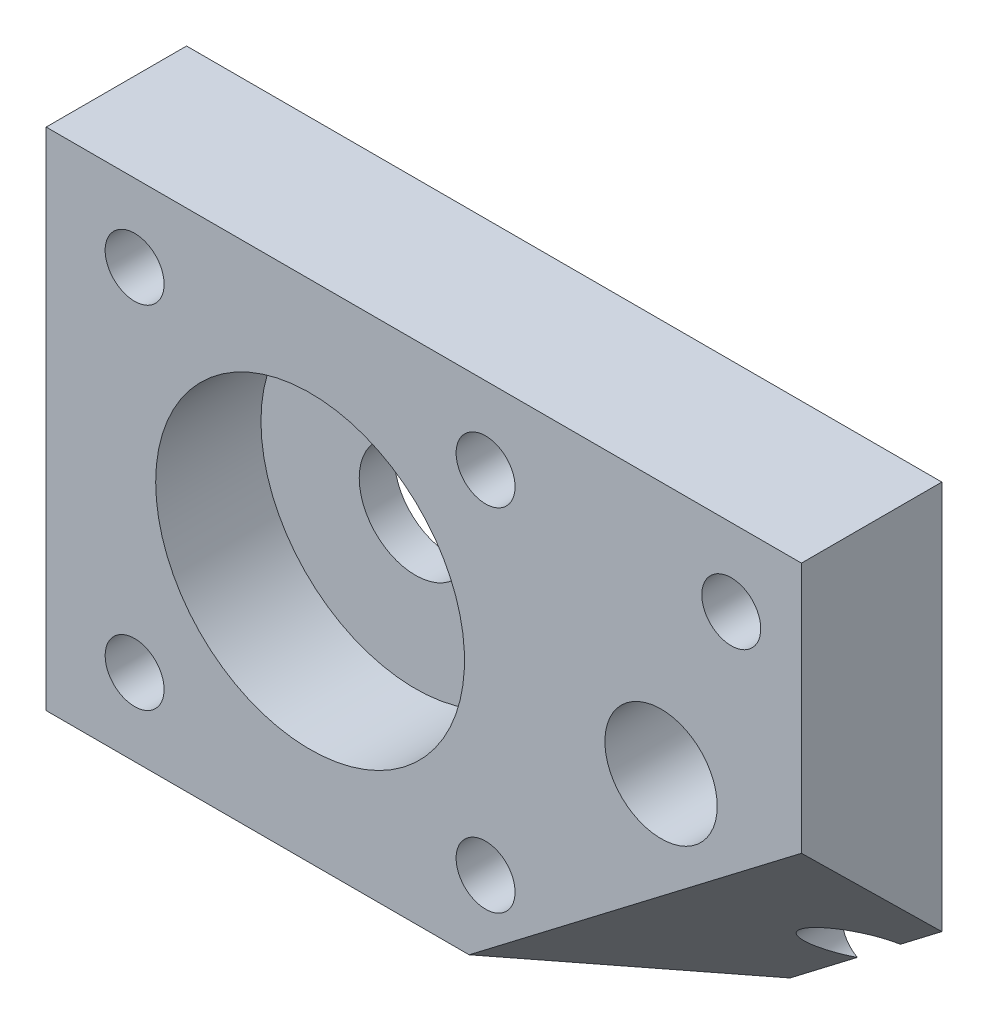
ISO-10303-21;
HEADER;
FILE_DESCRIPTION(('STEP AP214'),'2;1');
FILE_NAME('part.step','',(''),(''),'','','');
FILE_SCHEMA(('AUTOMOTIVE_DESIGN { 1 0 10303 214 1 1 1 1 }'));
ENDSEC;
DATA;
#1=APPLICATION_CONTEXT('core data for automotive mechanical design processes');
#2=APPLICATION_PROTOCOL_DEFINITION('international standard','automotive_design',2000,#1);
#3=PRODUCT_CONTEXT('',#1,'mechanical');
#4=PRODUCT('Part','Part','',(#3));
#5=PRODUCT_RELATED_PRODUCT_CATEGORY('part','',(#4));
#6=PRODUCT_DEFINITION_FORMATION('','',#4);
#7=PRODUCT_DEFINITION_CONTEXT('part definition',#1,'design');
#8=PRODUCT_DEFINITION('design','',#6,#7);
#9=PRODUCT_DEFINITION_SHAPE('','',#8);
#10=(LENGTH_UNIT() NAMED_UNIT(*) SI_UNIT(.MILLI.,.METRE.));
#11=(NAMED_UNIT(*) PLANE_ANGLE_UNIT() SI_UNIT($,.RADIAN.));
#12=(NAMED_UNIT(*) SI_UNIT($,.STERADIAN.) SOLID_ANGLE_UNIT());
#13=UNCERTAINTY_MEASURE_WITH_UNIT(LENGTH_MEASURE(1.E-05),#10,'distance_accuracy_value','');
#14=(GEOMETRIC_REPRESENTATION_CONTEXT(3) GLOBAL_UNCERTAINTY_ASSIGNED_CONTEXT((#13)) GLOBAL_UNIT_ASSIGNED_CONTEXT((#10,
#11,#12)) REPRESENTATION_CONTEXT('',''));
#15=CARTESIAN_POINT('',(0.,0.,0.));
#16=DIRECTION('',(0.,0.,1.));
#17=DIRECTION('',(1.,0.,0.));
#18=AXIS2_PLACEMENT_3D('',#15,#16,#17);
#19=CARTESIAN_POINT('',(0.,0.,-10.));
#20=DIRECTION('',(0.,0.,-1.));
#21=DIRECTION('',(1.,0.,0.));
#22=AXIS2_PLACEMENT_3D('',#19,#20,#21);
#23=PLANE('',#22);
#24=DIRECTION('',(0.794388962001185,0.607409398223867,0.));
#25=VECTOR('',#24,1.);
#26=CARTESIAN_POINT('',(-4.95351045213241,6.47835551744492,-10.));
#27=LINE('',#26,#25);
#28=CARTESIAN_POINT('',(-10.8104435212914,2.,-10.));
#29=VERTEX_POINT('',#28);
#30=CARTESIAN_POINT('',(-6.01889257892802,5.66373805991482,-10.));
#31=VERTEX_POINT('',#30);
#32=EDGE_CURVE('E85',#29,#31,#27,.T.);
#33=ORIENTED_EDGE('',*,*,#32,.F.);
#34=DIRECTION('',(-1.,0.,0.));
#35=VECTOR('',#34,1.);
#36=CARTESIAN_POINT('',(0.,2.,-10.));
#37=LINE('',#36,#35);
#38=CARTESIAN_POINT('',(-53.8,2.,-10.));
#39=VERTEX_POINT('',#38);
#40=EDGE_CURVE('E95',#29,#39,#37,.T.);
#41=ORIENTED_EDGE('',*,*,#40,.T.);
#42=DIRECTION('',(0.,-1.,0.));
#43=VECTOR('',#42,1.);
#44=CARTESIAN_POINT('',(-53.8,0.,-10.));
#45=LINE('',#44,#43);
#46=CARTESIAN_POINT('',(-53.8,38.,-10.));
#47=VERTEX_POINT('',#46);
#48=EDGE_CURVE('E41',#47,#39,#45,.T.);
#49=ORIENTED_EDGE('',*,*,#48,.F.);
#50=DIRECTION('',(1.,0.,0.));
#51=VECTOR('',#50,1.);
#52=CARTESIAN_POINT('',(-53.8,38.,-10.));
#53=LINE('',#52,#51);
#54=CARTESIAN_POINT('',(0.,38.,-10.));
#55=VERTEX_POINT('',#54);
#56=EDGE_CURVE('E235',#47,#55,#53,.T.);
#57=ORIENTED_EDGE('',*,*,#56,.T.);
#58=DIRECTION('',(0.,1.,0.));
#59=VECTOR('',#58,1.);
#60=CARTESIAN_POINT('',(0.,0.,-10.));
#61=LINE('',#60,#59);
#62=CARTESIAN_POINT('',(0.,10.2659318141318,-10.));
#63=VERTEX_POINT('',#62);
#64=EDGE_CURVE('E153',#63,#55,#61,.T.);
#65=ORIENTED_EDGE('',*,*,#64,.F.);
#66=CARTESIAN_POINT('',(-2.96087673435767,8.00197241708701,-10.));
#67=VERTEX_POINT('',#66);
#68=EDGE_CURVE('E102',#67,#63,#27,.T.);
#69=ORIENTED_EDGE('',*,*,#68,.F.);
#70=CARTESIAN_POINT('',(-5.,7.49999999999999,-10.));
#71=DIRECTION('',(0.,0.,1.));
#72=DIRECTION('',(-1.,0.,0.));
#73=AXIS2_PLACEMENT_3D('',#70,#71,#72);
#74=CIRCLE('',#73,2.1);
#75=EDGE_CURVE('E99',#67,#31,#74,.T.);
#76=ORIENTED_EDGE('',*,*,#75,.T.);
#77=EDGE_LOOP('',(#33,#41,#49,#57,#65,#69,#76));
#78=FACE_BOUND('',#77,.T.);
#79=CARTESIAN_POINT('',(-9.99999999999931,20.,-10.));
#80=DIRECTION('',(0.,0.,1.));
#81=DIRECTION('',(1.,0.,0.));
#82=AXIS2_PLACEMENT_3D('',#79,#80,#81);
#83=CIRCLE('',#82,3.99999999999931);
#84=CARTESIAN_POINT('',(-6.,20.,-10.));
#85=VERTEX_POINT('',#84);
#86=EDGE_CURVE('E222',#85,#85,#83,.T.);
#87=ORIENTED_EDGE('',*,*,#86,.T.);
#88=EDGE_LOOP('',(#87));
#89=FACE_BOUND('',#88,.T.);
#90=CARTESIAN_POINT('',(-22.5,7.5,-10.));
#91=DIRECTION('',(0.,0.,1.));
#92=DIRECTION('',(1.,0.,0.));
#93=AXIS2_PLACEMENT_3D('',#90,#91,#92);
#94=CIRCLE('',#93,2.1);
#95=CARTESIAN_POINT('',(-20.4,7.5,-10.));
#96=VERTEX_POINT('',#95);
#97=EDGE_CURVE('E129',#96,#96,#94,.T.);
#98=ORIENTED_EDGE('',*,*,#97,.T.);
#99=EDGE_LOOP('',(#98));
#100=FACE_BOUND('',#99,.T.);
#101=CARTESIAN_POINT('',(-47.5,7.49999999999998,-10.));
#102=DIRECTION('',(0.,0.,1.));
#103=DIRECTION('',(-1.,0.,0.));
#104=AXIS2_PLACEMENT_3D('',#101,#102,#103);
#105=CIRCLE('',#104,2.1);
#106=CARTESIAN_POINT('',(-49.6,7.49999999999998,-10.));
#107=VERTEX_POINT('',#106);
#108=EDGE_CURVE('E141',#107,#107,#105,.T.);
#109=ORIENTED_EDGE('',*,*,#108,.T.);
#110=EDGE_LOOP('',(#109));
#111=FACE_BOUND('',#110,.T.);
#112=CARTESIAN_POINT('',(-22.5,32.5,-10.));
#113=DIRECTION('',(0.,0.,1.));
#114=DIRECTION('',(1.,0.,0.));
#115=AXIS2_PLACEMENT_3D('',#112,#113,#114);
#116=CIRCLE('',#115,2.1);
#117=CARTESIAN_POINT('',(-20.4,32.5,-10.));
#118=VERTEX_POINT('',#117);
#119=EDGE_CURVE('E147',#118,#118,#116,.T.);
#120=ORIENTED_EDGE('',*,*,#119,.T.);
#121=EDGE_LOOP('',(#120));
#122=FACE_BOUND('',#121,.T.);
#123=CARTESIAN_POINT('',(-47.5,32.5,-10.));
#124=DIRECTION('',(0.,0.,1.));
#125=DIRECTION('',(1.,0.,0.));
#126=AXIS2_PLACEMENT_3D('',#123,#124,#125);
#127=CIRCLE('',#126,2.1);
#128=CARTESIAN_POINT('',(-45.4,32.5,-10.));
#129=VERTEX_POINT('',#128);
#130=EDGE_CURVE('E135',#129,#129,#127,.T.);
#131=ORIENTED_EDGE('',*,*,#130,.T.);
#132=EDGE_LOOP('',(#131));
#133=FACE_BOUND('',#132,.T.);
#134=CARTESIAN_POINT('',(-5.,32.5,-10.));
#135=DIRECTION('',(0.,0.,1.));
#136=DIRECTION('',(1.,0.,0.));
#137=AXIS2_PLACEMENT_3D('',#134,#135,#136);
#138=CIRCLE('',#137,2.1);
#139=CARTESIAN_POINT('',(-2.9,32.5,-10.));
#140=VERTEX_POINT('',#139);
#141=EDGE_CURVE('E123',#140,#140,#138,.T.);
#142=ORIENTED_EDGE('',*,*,#141,.T.);
#143=EDGE_LOOP('',(#142));
#144=FACE_BOUND('',#143,.T.);
#145=CARTESIAN_POINT('',(-35.,20.,-10.));
#146=DIRECTION('',(0.,0.,1.));
#147=DIRECTION('',(1.,0.,0.));
#148=AXIS2_PLACEMENT_3D('',#145,#146,#147);
#149=CIRCLE('',#148,4.);
#150=CARTESIAN_POINT('',(-31.,20.,-10.));
#151=VERTEX_POINT('',#150);
#152=EDGE_CURVE('E118',#151,#151,#149,.T.);
#153=ORIENTED_EDGE('',*,*,#152,.T.);
#154=EDGE_LOOP('',(#153));
#155=FACE_BOUND('',#154,.T.);
#156=ADVANCED_FACE('F33',(#78,#89,#100,#111,#122,#133,#144,#155),#23,.T.);
#157=CARTESIAN_POINT('',(0.,0.,0.));
#158=DIRECTION('',(0.,0.,-1.));
#159=DIRECTION('',(1.,0.,0.));
#160=AXIS2_PLACEMENT_3D('',#157,#158,#159);
#161=PLANE('',#160);
#162=CARTESIAN_POINT('',(-9.99999999999931,20.,0.));
#163=DIRECTION('',(0.,0.,1.));
#164=DIRECTION('',(1.,0.,0.));
#165=AXIS2_PLACEMENT_3D('',#162,#163,#164);
#166=CIRCLE('',#165,3.99999999999931);
#167=CARTESIAN_POINT('',(-6.,20.,0.));
#168=VERTEX_POINT('',#167);
#169=EDGE_CURVE('E226',#168,#168,#166,.T.);
#170=ORIENTED_EDGE('',*,*,#169,.F.);
#171=EDGE_LOOP('',(#170));
#172=FACE_BOUND('',#171,.T.);
#173=CARTESIAN_POINT('',(-34.9999999999993,19.9999999999776,0.));
#174=DIRECTION('',(0.,0.,-1.));
#175=DIRECTION('',(-1.,0.,0.));
#176=AXIS2_PLACEMENT_3D('',#173,#174,#175);
#177=CIRCLE('',#176,11.0000000000071);
#178=CARTESIAN_POINT('',(-46.0000000000064,19.9999999999776,0.));
#179=VERTEX_POINT('',#178);
#180=EDGE_CURVE('E106',#179,#179,#177,.T.);
#181=ORIENTED_EDGE('',*,*,#180,.T.);
#182=EDGE_LOOP('',(#181));
#183=FACE_BOUND('',#182,.T.);
#184=CARTESIAN_POINT('',(-22.5,32.5,0.));
#185=DIRECTION('',(0.,0.,1.));
#186=DIRECTION('',(1.,0.,0.));
#187=AXIS2_PLACEMENT_3D('',#184,#185,#186);
#188=CIRCLE('',#187,2.1);
#189=CARTESIAN_POINT('',(-20.4,32.5,0.));
#190=VERTEX_POINT('',#189);
#191=EDGE_CURVE('E144',#190,#190,#188,.T.);
#192=ORIENTED_EDGE('',*,*,#191,.F.);
#193=EDGE_LOOP('',(#192));
#194=FACE_BOUND('',#193,.T.);
#195=CARTESIAN_POINT('',(-47.5,7.49999999999998,0.));
#196=DIRECTION('',(0.,0.,1.));
#197=DIRECTION('',(-1.,0.,0.));
#198=AXIS2_PLACEMENT_3D('',#195,#196,#197);
#199=CIRCLE('',#198,2.1);
#200=CARTESIAN_POINT('',(-49.6,7.49999999999998,0.));
#201=VERTEX_POINT('',#200);
#202=EDGE_CURVE('E138',#201,#201,#199,.T.);
#203=ORIENTED_EDGE('',*,*,#202,.F.);
#204=EDGE_LOOP('',(#203));
#205=FACE_BOUND('',#204,.T.);
#206=CARTESIAN_POINT('',(-47.5,32.5,0.));
#207=DIRECTION('',(0.,0.,1.));
#208=DIRECTION('',(1.,0.,0.));
#209=AXIS2_PLACEMENT_3D('',#206,#207,#208);
#210=CIRCLE('',#209,2.1);
#211=CARTESIAN_POINT('',(-45.4,32.5,0.));
#212=VERTEX_POINT('',#211);
#213=EDGE_CURVE('E132',#212,#212,#210,.T.);
#214=ORIENTED_EDGE('',*,*,#213,.F.);
#215=EDGE_LOOP('',(#214));
#216=FACE_BOUND('',#215,.T.);
#217=CARTESIAN_POINT('',(-22.5,7.5,0.));
#218=DIRECTION('',(0.,0.,1.));
#219=DIRECTION('',(1.,0.,0.));
#220=AXIS2_PLACEMENT_3D('',#217,#218,#219);
#221=CIRCLE('',#220,2.1);
#222=CARTESIAN_POINT('',(-20.4,7.5,0.));
#223=VERTEX_POINT('',#222);
#224=EDGE_CURVE('E126',#223,#223,#221,.T.);
#225=ORIENTED_EDGE('',*,*,#224,.F.);
#226=EDGE_LOOP('',(#225));
#227=FACE_BOUND('',#226,.T.);
#228=CARTESIAN_POINT('',(-5.,32.5,0.));
#229=DIRECTION('',(0.,0.,1.));
#230=DIRECTION('',(1.,0.,0.));
#231=AXIS2_PLACEMENT_3D('',#228,#229,#230);
#232=CIRCLE('',#231,2.1);
#233=CARTESIAN_POINT('',(-2.9,32.5,0.));
#234=VERTEX_POINT('',#233);
#235=EDGE_CURVE('E122',#234,#234,#232,.T.);
#236=ORIENTED_EDGE('',*,*,#235,.F.);
#237=EDGE_LOOP('',(#236));
#238=FACE_BOUND('',#237,.T.);
#239=DIRECTION('',(1.,0.,0.));
#240=VECTOR('',#239,1.);
#241=CARTESIAN_POINT('',(-53.8,2.,0.));
#242=LINE('',#241,#240);
#243=CARTESIAN_POINT('',(-53.8,2.,0.));
#244=VERTEX_POINT('',#243);
#245=CARTESIAN_POINT('',(-23.6730305802222,2.,0.));
#246=VERTEX_POINT('',#245);
#247=EDGE_CURVE('E107',#244,#246,#242,.T.);
#248=ORIENTED_EDGE('',*,*,#247,.T.);
#249=DIRECTION('',(0.794388962001185,0.607409398223867,0.));
#250=VECTOR('',#249,1.);
#251=CARTESIAN_POINT('',(-9.69911277450645,12.6848022961161,0.));
#252=LINE('',#251,#250);
#253=CARTESIAN_POINT('',(0.,20.100983204304,0.));
#254=VERTEX_POINT('',#253);
#255=EDGE_CURVE('E47',#246,#254,#252,.T.);
#256=ORIENTED_EDGE('',*,*,#255,.T.);
#257=DIRECTION('',(0.,1.,0.));
#258=VECTOR('',#257,1.);
#259=CARTESIAN_POINT('',(0.,0.,0.));
#260=LINE('',#259,#258);
#261=CARTESIAN_POINT('',(0.,38.,0.));
#262=VERTEX_POINT('',#261);
#263=EDGE_CURVE('E150',#254,#262,#260,.T.);
#264=ORIENTED_EDGE('',*,*,#263,.T.);
#265=DIRECTION('',(-1.,0.,0.));
#266=VECTOR('',#265,1.);
#267=CARTESIAN_POINT('',(0.,38.,0.));
#268=LINE('',#267,#266);
#269=CARTESIAN_POINT('',(-53.8,38.,0.));
#270=VERTEX_POINT('',#269);
#271=EDGE_CURVE('E231',#262,#270,#268,.T.);
#272=ORIENTED_EDGE('',*,*,#271,.T.);
#273=DIRECTION('',(0.,-1.,0.));
#274=VECTOR('',#273,1.);
#275=CARTESIAN_POINT('',(-53.8,0.,0.));
#276=LINE('',#275,#274);
#277=EDGE_CURVE('E155',#270,#244,#276,.T.);
#278=ORIENTED_EDGE('',*,*,#277,.T.);
#279=EDGE_LOOP('',(#248,#256,#264,#272,#278));
#280=FACE_BOUND('',#279,.T.);
#281=ADVANCED_FACE('F183',(#172,#183,#194,#205,#216,#227,#238,#280),#161,.F.);
#282=CARTESIAN_POINT('',(0.,0.,-10.));
#283=DIRECTION('',(-1.,0.,0.));
#284=DIRECTION('',(0.,0.,-1.));
#285=AXIS2_PLACEMENT_3D('',#282,#283,#284);
#286=PLANE('',#285);
#287=ORIENTED_EDGE('',*,*,#263,.F.);
#288=DIRECTION('',(0.,-0.701202223902822,-0.712962440240534));
#289=VECTOR('',#288,1.);
#290=CARTESIAN_POINT('',(0.,5.21833165936522,-15.132256004082));
#291=LINE('',#290,#289);
#292=EDGE_CURVE('E216',#254,#63,#291,.T.);
#293=ORIENTED_EDGE('',*,*,#292,.T.);
#294=ORIENTED_EDGE('',*,*,#64,.T.);
#295=DIRECTION('',(0.,0.,1.));
#296=VECTOR('',#295,1.);
#297=CARTESIAN_POINT('',(0.,38.,-10.));
#298=LINE('',#297,#296);
#299=EDGE_CURVE('E225',#55,#262,#298,.T.);
#300=ORIENTED_EDGE('',*,*,#299,.T.);
#301=EDGE_LOOP('',(#287,#293,#294,#300));
#302=FACE_BOUND('',#301,.T.);
#303=ADVANCED_FACE('F35',(#302),#286,.F.);
#304=CARTESIAN_POINT('',(-53.8,0.,-10.));
#305=DIRECTION('',(1.,0.,0.));
#306=DIRECTION('',(0.,0.,1.));
#307=AXIS2_PLACEMENT_3D('',#304,#305,#306);
#308=PLANE('',#307);
#309=DIRECTION('',(0.,0.,-1.));
#310=VECTOR('',#309,1.);
#311=CARTESIAN_POINT('',(-53.8,38.,0.));
#312=LINE('',#311,#310);
#313=EDGE_CURVE('E55',#270,#47,#312,.T.);
#314=ORIENTED_EDGE('',*,*,#313,.T.);
#315=ORIENTED_EDGE('',*,*,#48,.T.);
#316=DIRECTION('',(0.,0.,1.));
#317=VECTOR('',#316,1.);
#318=CARTESIAN_POINT('',(-53.8,2.,-10.));
#319=LINE('',#318,#317);
#320=EDGE_CURVE('E104',#39,#244,#319,.T.);
#321=ORIENTED_EDGE('',*,*,#320,.T.);
#322=ORIENTED_EDGE('',*,*,#277,.F.);
#323=EDGE_LOOP('',(#314,#315,#321,#322));
#324=FACE_BOUND('',#323,.T.);
#325=ADVANCED_FACE('F168',(#324),#308,.F.);
#326=CARTESIAN_POINT('',(-35.,20.,-10.));
#327=DIRECTION('',(0.,0.,1.));
#328=DIRECTION('',(-1.,0.,0.));
#329=AXIS2_PLACEMENT_3D('',#326,#327,#328);
#330=CYLINDRICAL_SURFACE('',#329,4.);
#331=ORIENTED_EDGE('',*,*,#152,.F.);
#332=EDGE_LOOP('',(#331));
#333=FACE_BOUND('',#332,.T.);
#334=CARTESIAN_POINT('',(-35.,20.,-7.5));
#335=DIRECTION('',(0.,0.,-1.));
#336=DIRECTION('',(-1.,0.,0.));
#337=AXIS2_PLACEMENT_3D('',#334,#335,#336);
#338=CIRCLE('',#337,4.);
#339=CARTESIAN_POINT('',(-39.,20.,-7.5));
#340=VERTEX_POINT('',#339);
#341=EDGE_CURVE('E116',#340,#340,#338,.T.);
#342=ORIENTED_EDGE('',*,*,#341,.F.);
#343=EDGE_LOOP('',(#342));
#344=FACE_BOUND('',#343,.T.);
#345=ADVANCED_FACE('F165',(#333,#344),#330,.F.);
#346=CARTESIAN_POINT('',(-22.5,32.5,-10.));
#347=DIRECTION('',(0.,0.,1.));
#348=DIRECTION('',(-1.,0.,0.));
#349=AXIS2_PLACEMENT_3D('',#346,#347,#348);
#350=CYLINDRICAL_SURFACE('',#349,2.1);
#351=ORIENTED_EDGE('',*,*,#119,.F.);
#352=EDGE_LOOP('',(#351));
#353=FACE_BOUND('',#352,.T.);
#354=ORIENTED_EDGE('',*,*,#191,.T.);
#355=EDGE_LOOP('',(#354));
#356=FACE_BOUND('',#355,.T.);
#357=ADVANCED_FACE('F167',(#353,#356),#350,.F.);
#358=CARTESIAN_POINT('',(-47.5,7.49999999999998,-10.));
#359=DIRECTION('',(0.,0.,1.));
#360=DIRECTION('',(-1.,0.,0.));
#361=AXIS2_PLACEMENT_3D('',#358,#359,#360);
#362=CYLINDRICAL_SURFACE('',#361,2.1);
#363=ORIENTED_EDGE('',*,*,#108,.F.);
#364=EDGE_LOOP('',(#363));
#365=FACE_BOUND('',#364,.T.);
#366=ORIENTED_EDGE('',*,*,#202,.T.);
#367=EDGE_LOOP('',(#366));
#368=FACE_BOUND('',#367,.T.);
#369=ADVANCED_FACE('F175',(#365,#368),#362,.F.);
#370=CARTESIAN_POINT('',(-47.5,32.5,-10.));
#371=DIRECTION('',(0.,0.,1.));
#372=DIRECTION('',(-1.,0.,0.));
#373=AXIS2_PLACEMENT_3D('',#370,#371,#372);
#374=CYLINDRICAL_SURFACE('',#373,2.1);
#375=ORIENTED_EDGE('',*,*,#130,.F.);
#376=EDGE_LOOP('',(#375));
#377=FACE_BOUND('',#376,.T.);
#378=ORIENTED_EDGE('',*,*,#213,.T.);
#379=EDGE_LOOP('',(#378));
#380=FACE_BOUND('',#379,.T.);
#381=ADVANCED_FACE('F194',(#377,#380),#374,.F.);
#382=CARTESIAN_POINT('',(-22.5,7.5,-10.));
#383=DIRECTION('',(0.,0.,1.));
#384=DIRECTION('',(-1.,0.,0.));
#385=AXIS2_PLACEMENT_3D('',#382,#383,#384);
#386=CYLINDRICAL_SURFACE('',#385,2.1);
#387=ORIENTED_EDGE('',*,*,#97,.F.);
#388=EDGE_LOOP('',(#387));
#389=FACE_BOUND('',#388,.T.);
#390=ORIENTED_EDGE('',*,*,#224,.T.);
#391=EDGE_LOOP('',(#390));
#392=FACE_BOUND('',#391,.T.);
#393=ADVANCED_FACE('F198',(#389,#392),#386,.F.);
#394=CARTESIAN_POINT('',(-5.,32.5,-10.));
#395=DIRECTION('',(0.,0.,1.));
#396=DIRECTION('',(-1.,0.,0.));
#397=AXIS2_PLACEMENT_3D('',#394,#395,#396);
#398=CYLINDRICAL_SURFACE('',#397,2.1);
#399=ORIENTED_EDGE('',*,*,#141,.F.);
#400=EDGE_LOOP('',(#399));
#401=FACE_BOUND('',#400,.T.);
#402=ORIENTED_EDGE('',*,*,#235,.T.);
#403=EDGE_LOOP('',(#402));
#404=FACE_BOUND('',#403,.T.);
#405=ADVANCED_FACE('F202',(#401,#404),#398,.F.);
#406=CARTESIAN_POINT('',(-5.,7.49999999999999,-10.));
#407=DIRECTION('',(0.,0.,1.));
#408=DIRECTION('',(-1.,0.,0.));
#409=AXIS2_PLACEMENT_3D('',#406,#407,#408);
#410=CYLINDRICAL_SURFACE('',#409,2.1);
#411=CARTESIAN_POINT('',(-5.,7.49999999999999,-8.92507776947067));
#412=DIRECTION('',(-0.478645137642194,0.625987044603415,-0.61566147532566));
#413=DIRECTION('',(-0.373958566237177,0.489074680328069,0.788010753606721));
#414=AXIS2_PLACEMENT_3D('',#411,#412,#413);
#415=ELLIPSE('',#414,3.41096541551375,2.1);
#416=EDGE_CURVE('E100',#31,#67,#415,.T.);
#417=ORIENTED_EDGE('',*,*,#416,.F.);
#418=ORIENTED_EDGE('',*,*,#75,.F.);
#419=EDGE_LOOP('',(#417,#418));
#420=FACE_BOUND('',#419,.T.);
#421=ADVANCED_FACE('F205',(#420),#410,.F.);
#422=CARTESIAN_POINT('',(-34.9999999999993,19.9999999999776,-7.5));
#423=DIRECTION('',(0.,0.,1.));
#424=DIRECTION('',(-1.,0.,0.));
#425=AXIS2_PLACEMENT_3D('',#422,#423,#424);
#426=CYLINDRICAL_SURFACE('',#425,11.0000000000071);
#427=CARTESIAN_POINT('',(-34.9999999999993,19.9999999999776,-7.5));
#428=DIRECTION('',(0.,0.,-1.));
#429=DIRECTION('',(-1.,0.,0.));
#430=AXIS2_PLACEMENT_3D('',#427,#428,#429);
#431=CIRCLE('',#430,11.0000000000071);
#432=CARTESIAN_POINT('',(-46.0000000000064,19.9999999999776,-7.5));
#433=VERTEX_POINT('',#432);
#434=EDGE_CURVE('E110',#433,#433,#431,.T.);
#435=ORIENTED_EDGE('',*,*,#434,.T.);
#436=EDGE_LOOP('',(#435));
#437=FACE_BOUND('',#436,.T.);
#438=ORIENTED_EDGE('',*,*,#180,.F.);
#439=EDGE_LOOP('',(#438));
#440=FACE_BOUND('',#439,.T.);
#441=ADVANCED_FACE('F208',(#437,#440),#426,.F.);
#442=CARTESIAN_POINT('',(-34.9999999999993,19.9999999999776,-7.5));
#443=DIRECTION('',(0.,0.,1.));
#444=DIRECTION('',(-1.,0.,0.));
#445=AXIS2_PLACEMENT_3D('',#442,#443,#444);
#446=PLANE('',#445);
#447=ORIENTED_EDGE('',*,*,#341,.T.);
#448=EDGE_LOOP('',(#447));
#449=FACE_BOUND('',#448,.T.);
#450=ORIENTED_EDGE('',*,*,#434,.F.);
#451=EDGE_LOOP('',(#450));
#452=FACE_BOUND('',#451,.T.);
#453=ADVANCED_FACE('F162',(#449,#452),#446,.T.);
#454=CARTESIAN_POINT('',(0.,2.,0.));
#455=DIRECTION('',(0.,-1.,0.));
#456=DIRECTION('',(0.,0.,1.));
#457=AXIS2_PLACEMENT_3D('',#454,#455,#456);
#458=PLANE('',#457);
#459=DIRECTION('',(0.789478150927466,0.,-0.613778664673308));
#460=VECTOR('',#459,1.);
#461=CARTESIAN_POINT('',(-8.91820467181574,2.,-11.4711184000593));
#462=LINE('',#461,#460);
#463=EDGE_CURVE('E11',#246,#29,#462,.T.);
#464=ORIENTED_EDGE('',*,*,#463,.F.);
#465=ORIENTED_EDGE('',*,*,#247,.F.);
#466=ORIENTED_EDGE('',*,*,#320,.F.);
#467=ORIENTED_EDGE('',*,*,#40,.F.);
#468=EDGE_LOOP('',(#464,#465,#466,#467));
#469=FACE_BOUND('',#468,.T.);
#470=ADVANCED_FACE('F103',(#469),#458,.T.);
#471=CARTESIAN_POINT('',(0.,38.,0.));
#472=DIRECTION('',(0.,1.,0.));
#473=DIRECTION('',(-1.,0.,0.));
#474=AXIS2_PLACEMENT_3D('',#471,#472,#473);
#475=PLANE('',#474);
#476=ORIENTED_EDGE('',*,*,#299,.F.);
#477=ORIENTED_EDGE('',*,*,#56,.F.);
#478=ORIENTED_EDGE('',*,*,#313,.F.);
#479=ORIENTED_EDGE('',*,*,#271,.F.);
#480=EDGE_LOOP('',(#476,#477,#478,#479));
#481=FACE_BOUND('',#480,.T.);
#482=ADVANCED_FACE('F240',(#481),#475,.T.);
#483=CARTESIAN_POINT('',(-9.99999999999931,20.,-10.));
#484=DIRECTION('',(0.,0.,1.));
#485=DIRECTION('',(1.,0.,0.));
#486=AXIS2_PLACEMENT_3D('',#483,#484,#485);
#487=CYLINDRICAL_SURFACE('',#486,3.99999999999931);
#488=ORIENTED_EDGE('',*,*,#86,.F.);
#489=EDGE_LOOP('',(#488));
#490=FACE_BOUND('',#489,.T.);
#491=ORIENTED_EDGE('',*,*,#169,.T.);
#492=EDGE_LOOP('',(#491));
#493=FACE_BOUND('',#492,.T.);
#494=ADVANCED_FACE('F321',(#490,#493),#487,.F.);
#495=CARTESIAN_POINT('',(-6.02277026127498,7.87676685644975,-7.74684068215883));
#496=DIRECTION('',(-0.478645137642194,0.625987044603415,-0.61566147532566));
#497=DIRECTION('',(0.,0.701202223902822,0.712962440240534));
#498=AXIS2_PLACEMENT_3D('',#495,#496,#497);
#499=PLANE('',#498);
#500=ORIENTED_EDGE('',*,*,#68,.T.);
#501=ORIENTED_EDGE('',*,*,#292,.F.);
#502=ORIENTED_EDGE('',*,*,#255,.F.);
#503=ORIENTED_EDGE('',*,*,#463,.T.);
#504=ORIENTED_EDGE('',*,*,#32,.T.);
#505=ORIENTED_EDGE('',*,*,#416,.T.);
#506=EDGE_LOOP('',(#500,#501,#502,#503,#504,#505));
#507=FACE_BOUND('',#506,.T.);
#508=ADVANCED_FACE('F84',(#507),#499,.F.);
#509=CLOSED_SHELL('',(#156,#281,#303,#325,#345,#357,#369,#381,#393,#405,#421,#441,#453,#470,
#482,#494,#508));
#510=MANIFOLD_SOLID_BREP('B2',#509);
#511=ADVANCED_BREP_SHAPE_REPRESENTATION('',(#18,#510),#14);
#512=SHAPE_DEFINITION_REPRESENTATION(#9,#511);
ENDSEC;
END-ISO-10303-21;
